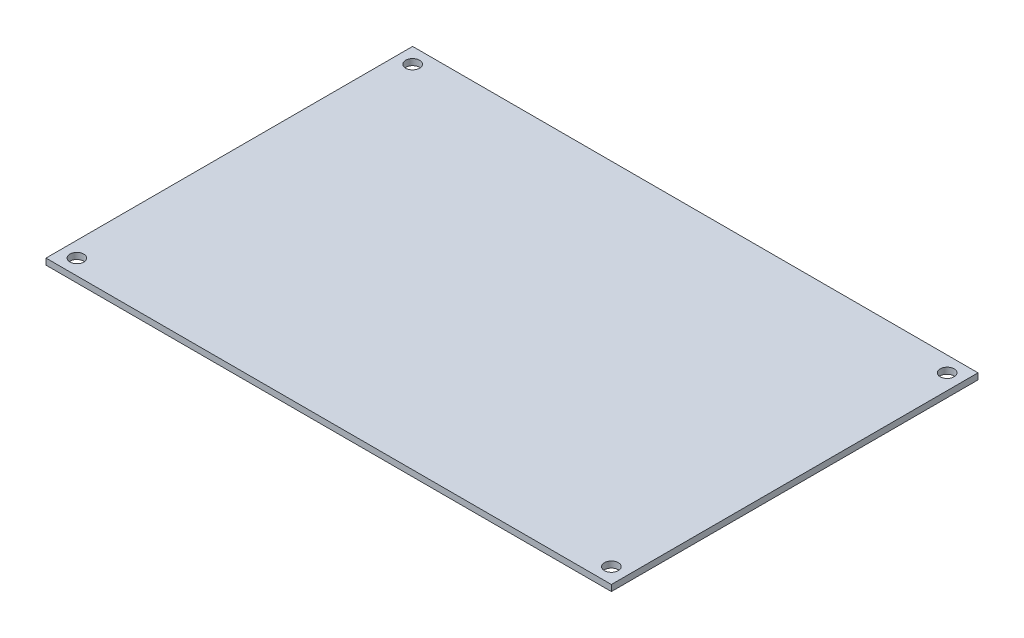
ISO-10303-21;
HEADER;
FILE_DESCRIPTION(('STEP AP214'),'2;1');
FILE_NAME('part.step','',(''),(''),'','','');
FILE_SCHEMA(('AUTOMOTIVE_DESIGN { 1 0 10303 214 1 1 1 1 }'));
ENDSEC;
DATA;
#1=APPLICATION_CONTEXT('core data for automotive mechanical design processes');
#2=APPLICATION_PROTOCOL_DEFINITION('international standard','automotive_design',2000,#1);
#3=PRODUCT_CONTEXT('',#1,'mechanical');
#4=PRODUCT('Part','Part','',(#3));
#5=PRODUCT_RELATED_PRODUCT_CATEGORY('part','',(#4));
#6=PRODUCT_DEFINITION_FORMATION('','',#4);
#7=PRODUCT_DEFINITION_CONTEXT('part definition',#1,'design');
#8=PRODUCT_DEFINITION('design','',#6,#7);
#9=PRODUCT_DEFINITION_SHAPE('','',#8);
#10=(LENGTH_UNIT() NAMED_UNIT(*) SI_UNIT(.MILLI.,.METRE.));
#11=(NAMED_UNIT(*) PLANE_ANGLE_UNIT() SI_UNIT($,.RADIAN.));
#12=(NAMED_UNIT(*) SI_UNIT($,.STERADIAN.) SOLID_ANGLE_UNIT());
#13=UNCERTAINTY_MEASURE_WITH_UNIT(LENGTH_MEASURE(1.E-05),#10,'distance_accuracy_value','');
#14=(GEOMETRIC_REPRESENTATION_CONTEXT(3) GLOBAL_UNCERTAINTY_ASSIGNED_CONTEXT((#13)) GLOBAL_UNIT_ASSIGNED_CONTEXT((#10,
#11,#12)) REPRESENTATION_CONTEXT('',''));
#15=CARTESIAN_POINT('',(0.,0.,0.));
#16=DIRECTION('',(0.,0.,1.));
#17=DIRECTION('',(1.,0.,0.));
#18=AXIS2_PLACEMENT_3D('',#15,#16,#17);
#19=CARTESIAN_POINT('',(-73.25,-1.6,-47.5));
#20=DIRECTION('',(-1.,0.,0.));
#21=DIRECTION('',(0.,0.,1.));
#22=AXIS2_PLACEMENT_3D('',#19,#20,#21);
#23=PLANE('',#22);
#24=DIRECTION('',(0.,0.,1.));
#25=VECTOR('',#24,1.);
#26=CARTESIAN_POINT('',(-73.25,0.,-47.5));
#27=LINE('',#26,#25);
#28=CARTESIAN_POINT('',(-73.25,0.,-47.5));
#29=VERTEX_POINT('',#28);
#30=CARTESIAN_POINT('',(-73.25,0.,47.5));
#31=VERTEX_POINT('',#30);
#32=EDGE_CURVE('E97',#29,#31,#27,.T.);
#33=ORIENTED_EDGE('',*,*,#32,.F.);
#34=DIRECTION('',(0.,1.,0.));
#35=VECTOR('',#34,1.);
#36=CARTESIAN_POINT('',(-73.25,-1.6,-47.5));
#37=LINE('',#36,#35);
#38=CARTESIAN_POINT('',(-73.25,-1.6,-47.5));
#39=VERTEX_POINT('',#38);
#40=EDGE_CURVE('E11',#39,#29,#37,.T.);
#41=ORIENTED_EDGE('',*,*,#40,.F.);
#42=DIRECTION('',(0.,0.,1.));
#43=VECTOR('',#42,1.);
#44=CARTESIAN_POINT('',(-73.25,-1.6,-47.5));
#45=LINE('',#44,#43);
#46=CARTESIAN_POINT('',(-73.25,-1.6,47.5));
#47=VERTEX_POINT('',#46);
#48=EDGE_CURVE('E90',#39,#47,#45,.T.);
#49=ORIENTED_EDGE('',*,*,#48,.T.);
#50=DIRECTION('',(0.,1.,0.));
#51=VECTOR('',#50,1.);
#52=CARTESIAN_POINT('',(-73.25,-1.6,47.5));
#53=LINE('',#52,#51);
#54=EDGE_CURVE('E35',#47,#31,#53,.T.);
#55=ORIENTED_EDGE('',*,*,#54,.T.);
#56=EDGE_LOOP('',(#33,#41,#49,#55));
#57=FACE_BOUND('',#56,.T.);
#58=ADVANCED_FACE('F32',(#57),#23,.T.);
#59=CARTESIAN_POINT('',(-73.25,-1.6,-47.5));
#60=DIRECTION('',(0.,0.,-1.));
#61=DIRECTION('',(-1.,0.,0.));
#62=AXIS2_PLACEMENT_3D('',#59,#60,#61);
#63=PLANE('',#62);
#64=DIRECTION('',(-1.,0.,0.));
#65=VECTOR('',#64,1.);
#66=CARTESIAN_POINT('',(-73.25,0.,-47.5));
#67=LINE('',#66,#65);
#68=CARTESIAN_POINT('',(73.25,0.,-47.5));
#69=VERTEX_POINT('',#68);
#70=EDGE_CURVE('E92',#69,#29,#67,.T.);
#71=ORIENTED_EDGE('',*,*,#70,.F.);
#72=DIRECTION('',(0.,1.,0.));
#73=VECTOR('',#72,1.);
#74=CARTESIAN_POINT('',(73.25,-1.6,-47.5));
#75=LINE('',#74,#73);
#76=CARTESIAN_POINT('',(73.25,-1.6,-47.5));
#77=VERTEX_POINT('',#76);
#78=EDGE_CURVE('E41',#77,#69,#75,.T.);
#79=ORIENTED_EDGE('',*,*,#78,.F.);
#80=DIRECTION('',(-1.,0.,0.));
#81=VECTOR('',#80,1.);
#82=CARTESIAN_POINT('',(-73.25,-1.6,-47.5));
#83=LINE('',#82,#81);
#84=EDGE_CURVE('E87',#77,#39,#83,.T.);
#85=ORIENTED_EDGE('',*,*,#84,.T.);
#86=ORIENTED_EDGE('',*,*,#40,.T.);
#87=EDGE_LOOP('',(#71,#79,#85,#86));
#88=FACE_BOUND('',#87,.T.);
#89=ADVANCED_FACE('F108',(#88),#63,.T.);
#90=CARTESIAN_POINT('',(73.25,-1.6,-47.5));
#91=DIRECTION('',(1.,0.,0.));
#92=DIRECTION('',(0.,0.,-1.));
#93=AXIS2_PLACEMENT_3D('',#90,#91,#92);
#94=PLANE('',#93);
#95=DIRECTION('',(0.,0.,-1.));
#96=VECTOR('',#95,1.);
#97=CARTESIAN_POINT('',(73.25,0.,-47.5));
#98=LINE('',#97,#96);
#99=CARTESIAN_POINT('',(73.25,0.,47.5));
#100=VERTEX_POINT('',#99);
#101=EDGE_CURVE('E82',#100,#69,#98,.T.);
#102=ORIENTED_EDGE('',*,*,#101,.F.);
#103=DIRECTION('',(0.,1.,0.));
#104=VECTOR('',#103,1.);
#105=CARTESIAN_POINT('',(73.25,-1.6,47.5));
#106=LINE('',#105,#104);
#107=CARTESIAN_POINT('',(73.25,-1.6,47.5));
#108=VERTEX_POINT('',#107);
#109=EDGE_CURVE('E77',#108,#100,#106,.T.);
#110=ORIENTED_EDGE('',*,*,#109,.F.);
#111=DIRECTION('',(0.,0.,-1.));
#112=VECTOR('',#111,1.);
#113=CARTESIAN_POINT('',(73.25,-1.6,-47.5));
#114=LINE('',#113,#112);
#115=EDGE_CURVE('E80',#108,#77,#114,.T.);
#116=ORIENTED_EDGE('',*,*,#115,.T.);
#117=ORIENTED_EDGE('',*,*,#78,.T.);
#118=EDGE_LOOP('',(#102,#110,#116,#117));
#119=FACE_BOUND('',#118,.T.);
#120=ADVANCED_FACE('F79',(#119),#94,.T.);
#121=CARTESIAN_POINT('',(-73.25,-1.6,47.5));
#122=DIRECTION('',(0.,0.,1.));
#123=DIRECTION('',(1.,0.,0.));
#124=AXIS2_PLACEMENT_3D('',#121,#122,#123);
#125=PLANE('',#124);
#126=DIRECTION('',(1.,0.,0.));
#127=VECTOR('',#126,1.);
#128=CARTESIAN_POINT('',(-73.25,0.,47.5));
#129=LINE('',#128,#127);
#130=EDGE_CURVE('E100',#31,#100,#129,.T.);
#131=ORIENTED_EDGE('',*,*,#130,.F.);
#132=ORIENTED_EDGE('',*,*,#54,.F.);
#133=DIRECTION('',(1.,0.,0.));
#134=VECTOR('',#133,1.);
#135=CARTESIAN_POINT('',(-73.25,-1.6,47.5));
#136=LINE('',#135,#134);
#137=EDGE_CURVE('E86',#47,#108,#136,.T.);
#138=ORIENTED_EDGE('',*,*,#137,.T.);
#139=ORIENTED_EDGE('',*,*,#109,.T.);
#140=EDGE_LOOP('',(#131,#132,#138,#139));
#141=FACE_BOUND('',#140,.T.);
#142=ADVANCED_FACE('F89',(#141),#125,.T.);
#143=CARTESIAN_POINT('',(0.,-1.6,0.));
#144=DIRECTION('',(0.,1.,0.));
#145=DIRECTION('',(0.,0.,1.));
#146=AXIS2_PLACEMENT_3D('',#143,#144,#145);
#147=PLANE('',#146);
#148=CARTESIAN_POINT('',(-69.25,-1.6,43.5));
#149=DIRECTION('',(0.,1.,0.));
#150=DIRECTION('',(0.,0.,1.));
#151=AXIS2_PLACEMENT_3D('',#148,#149,#150);
#152=CIRCLE('',#151,1.79999999999999);
#153=CARTESIAN_POINT('',(-69.25,-1.6,45.3));
#154=VERTEX_POINT('',#153);
#155=EDGE_CURVE('E149',#154,#154,#152,.T.);
#156=ORIENTED_EDGE('',*,*,#155,.T.);
#157=EDGE_LOOP('',(#156));
#158=FACE_BOUND('',#157,.T.);
#159=CARTESIAN_POINT('',(69.25,-1.6,43.5));
#160=DIRECTION('',(0.,1.,0.));
#161=DIRECTION('',(0.,0.,1.));
#162=AXIS2_PLACEMENT_3D('',#159,#160,#161);
#163=CIRCLE('',#162,1.79999999999999);
#164=CARTESIAN_POINT('',(69.25,-1.6,45.3));
#165=VERTEX_POINT('',#164);
#166=EDGE_CURVE('E157',#165,#165,#163,.T.);
#167=ORIENTED_EDGE('',*,*,#166,.T.);
#168=EDGE_LOOP('',(#167));
#169=FACE_BOUND('',#168,.T.);
#170=CARTESIAN_POINT('',(69.25,-1.6,-43.5));
#171=DIRECTION('',(0.,1.,0.));
#172=DIRECTION('',(0.,0.,1.));
#173=AXIS2_PLACEMENT_3D('',#170,#171,#172);
#174=CIRCLE('',#173,1.79999999999999);
#175=CARTESIAN_POINT('',(69.25,-1.6,-41.7));
#176=VERTEX_POINT('',#175);
#177=EDGE_CURVE('E163',#176,#176,#174,.T.);
#178=ORIENTED_EDGE('',*,*,#177,.T.);
#179=EDGE_LOOP('',(#178));
#180=FACE_BOUND('',#179,.T.);
#181=CARTESIAN_POINT('',(-69.25,-1.6,-43.5));
#182=DIRECTION('',(0.,1.,0.));
#183=DIRECTION('',(0.,0.,1.));
#184=AXIS2_PLACEMENT_3D('',#181,#182,#183);
#185=CIRCLE('',#184,1.79999999999999);
#186=CARTESIAN_POINT('',(-69.25,-1.6,-41.7));
#187=VERTEX_POINT('',#186);
#188=EDGE_CURVE('E101',#187,#187,#185,.T.);
#189=ORIENTED_EDGE('',*,*,#188,.T.);
#190=EDGE_LOOP('',(#189));
#191=FACE_BOUND('',#190,.T.);
#192=ORIENTED_EDGE('',*,*,#48,.F.);
#193=ORIENTED_EDGE('',*,*,#84,.F.);
#194=ORIENTED_EDGE('',*,*,#115,.F.);
#195=ORIENTED_EDGE('',*,*,#137,.F.);
#196=EDGE_LOOP('',(#192,#193,#194,#195));
#197=FACE_BOUND('',#196,.T.);
#198=ADVANCED_FACE('F85',(#158,#169,#180,#191,#197),#147,.F.);
#199=CARTESIAN_POINT('',(0.,0.,0.));
#200=DIRECTION('',(0.,1.,0.));
#201=DIRECTION('',(0.,0.,1.));
#202=AXIS2_PLACEMENT_3D('',#199,#200,#201);
#203=PLANE('',#202);
#204=CARTESIAN_POINT('',(-69.25,0.,43.5));
#205=DIRECTION('',(0.,1.,0.));
#206=DIRECTION('',(0.,0.,1.));
#207=AXIS2_PLACEMENT_3D('',#204,#205,#206);
#208=CIRCLE('',#207,1.79999999999999);
#209=CARTESIAN_POINT('',(-69.25,0.,45.3));
#210=VERTEX_POINT('',#209);
#211=EDGE_CURVE('E152',#210,#210,#208,.T.);
#212=ORIENTED_EDGE('',*,*,#211,.F.);
#213=EDGE_LOOP('',(#212));
#214=FACE_BOUND('',#213,.T.);
#215=CARTESIAN_POINT('',(69.25,0.,43.5));
#216=DIRECTION('',(0.,1.,0.));
#217=DIRECTION('',(0.,0.,1.));
#218=AXIS2_PLACEMENT_3D('',#215,#216,#217);
#219=CIRCLE('',#218,1.79999999999999);
#220=CARTESIAN_POINT('',(69.25,0.,45.3));
#221=VERTEX_POINT('',#220);
#222=EDGE_CURVE('E154',#221,#221,#219,.T.);
#223=ORIENTED_EDGE('',*,*,#222,.F.);
#224=EDGE_LOOP('',(#223));
#225=FACE_BOUND('',#224,.T.);
#226=CARTESIAN_POINT('',(69.25,0.,-43.5));
#227=DIRECTION('',(0.,1.,0.));
#228=DIRECTION('',(0.,0.,1.));
#229=AXIS2_PLACEMENT_3D('',#226,#227,#228);
#230=CIRCLE('',#229,1.79999999999999);
#231=CARTESIAN_POINT('',(69.25,0.,-41.7));
#232=VERTEX_POINT('',#231);
#233=EDGE_CURVE('E160',#232,#232,#230,.T.);
#234=ORIENTED_EDGE('',*,*,#233,.F.);
#235=EDGE_LOOP('',(#234));
#236=FACE_BOUND('',#235,.T.);
#237=CARTESIAN_POINT('',(-69.25,0.,-43.5));
#238=DIRECTION('',(0.,1.,0.));
#239=DIRECTION('',(0.,0.,1.));
#240=AXIS2_PLACEMENT_3D('',#237,#238,#239);
#241=CIRCLE('',#240,1.79999999999999);
#242=CARTESIAN_POINT('',(-69.25,0.,-41.7));
#243=VERTEX_POINT('',#242);
#244=EDGE_CURVE('E166',#243,#243,#241,.T.);
#245=ORIENTED_EDGE('',*,*,#244,.F.);
#246=EDGE_LOOP('',(#245));
#247=FACE_BOUND('',#246,.T.);
#248=ORIENTED_EDGE('',*,*,#32,.T.);
#249=ORIENTED_EDGE('',*,*,#130,.T.);
#250=ORIENTED_EDGE('',*,*,#101,.T.);
#251=ORIENTED_EDGE('',*,*,#70,.T.);
#252=EDGE_LOOP('',(#248,#249,#250,#251));
#253=FACE_BOUND('',#252,.T.);
#254=ADVANCED_FACE('F107',(#214,#225,#236,#247,#253),#203,.T.);
#255=CARTESIAN_POINT('',(-69.25,-1.6,-43.5));
#256=DIRECTION('',(0.,1.,0.));
#257=DIRECTION('',(0.,0.,1.));
#258=AXIS2_PLACEMENT_3D('',#255,#256,#257);
#259=CYLINDRICAL_SURFACE('',#258,1.79999999999999);
#260=ORIENTED_EDGE('',*,*,#188,.F.);
#261=EDGE_LOOP('',(#260));
#262=FACE_BOUND('',#261,.T.);
#263=ORIENTED_EDGE('',*,*,#244,.T.);
#264=EDGE_LOOP('',(#263));
#265=FACE_BOUND('',#264,.T.);
#266=ADVANCED_FACE('F126',(#262,#265),#259,.F.);
#267=CARTESIAN_POINT('',(69.25,-1.6,-43.5));
#268=DIRECTION('',(0.,1.,0.));
#269=DIRECTION('',(0.,0.,1.));
#270=AXIS2_PLACEMENT_3D('',#267,#268,#269);
#271=CYLINDRICAL_SURFACE('',#270,1.79999999999999);
#272=ORIENTED_EDGE('',*,*,#177,.F.);
#273=EDGE_LOOP('',(#272));
#274=FACE_BOUND('',#273,.T.);
#275=ORIENTED_EDGE('',*,*,#233,.T.);
#276=EDGE_LOOP('',(#275));
#277=FACE_BOUND('',#276,.T.);
#278=ADVANCED_FACE('F133',(#274,#277),#271,.F.);
#279=CARTESIAN_POINT('',(69.25,-1.6,43.5));
#280=DIRECTION('',(0.,1.,0.));
#281=DIRECTION('',(0.,0.,1.));
#282=AXIS2_PLACEMENT_3D('',#279,#280,#281);
#283=CYLINDRICAL_SURFACE('',#282,1.79999999999999);
#284=ORIENTED_EDGE('',*,*,#166,.F.);
#285=EDGE_LOOP('',(#284));
#286=FACE_BOUND('',#285,.T.);
#287=ORIENTED_EDGE('',*,*,#222,.T.);
#288=EDGE_LOOP('',(#287));
#289=FACE_BOUND('',#288,.T.);
#290=ADVANCED_FACE('F137',(#286,#289),#283,.F.);
#291=CARTESIAN_POINT('',(-69.25,-1.6,43.5));
#292=DIRECTION('',(0.,1.,0.));
#293=DIRECTION('',(0.,0.,1.));
#294=AXIS2_PLACEMENT_3D('',#291,#292,#293);
#295=CYLINDRICAL_SURFACE('',#294,1.79999999999999);
#296=ORIENTED_EDGE('',*,*,#155,.F.);
#297=EDGE_LOOP('',(#296));
#298=FACE_BOUND('',#297,.T.);
#299=ORIENTED_EDGE('',*,*,#211,.T.);
#300=EDGE_LOOP('',(#299));
#301=FACE_BOUND('',#300,.T.);
#302=ADVANCED_FACE('F141',(#298,#301),#295,.F.);
#303=CLOSED_SHELL('',(#58,#89,#120,#142,#198,#254,#266,#278,#290,#302));
#304=MANIFOLD_SOLID_BREP('B2',#303);
#305=ADVANCED_BREP_SHAPE_REPRESENTATION('',(#18,#304),#14);
#306=SHAPE_DEFINITION_REPRESENTATION(#9,#305);
ENDSEC;
END-ISO-10303-21;
